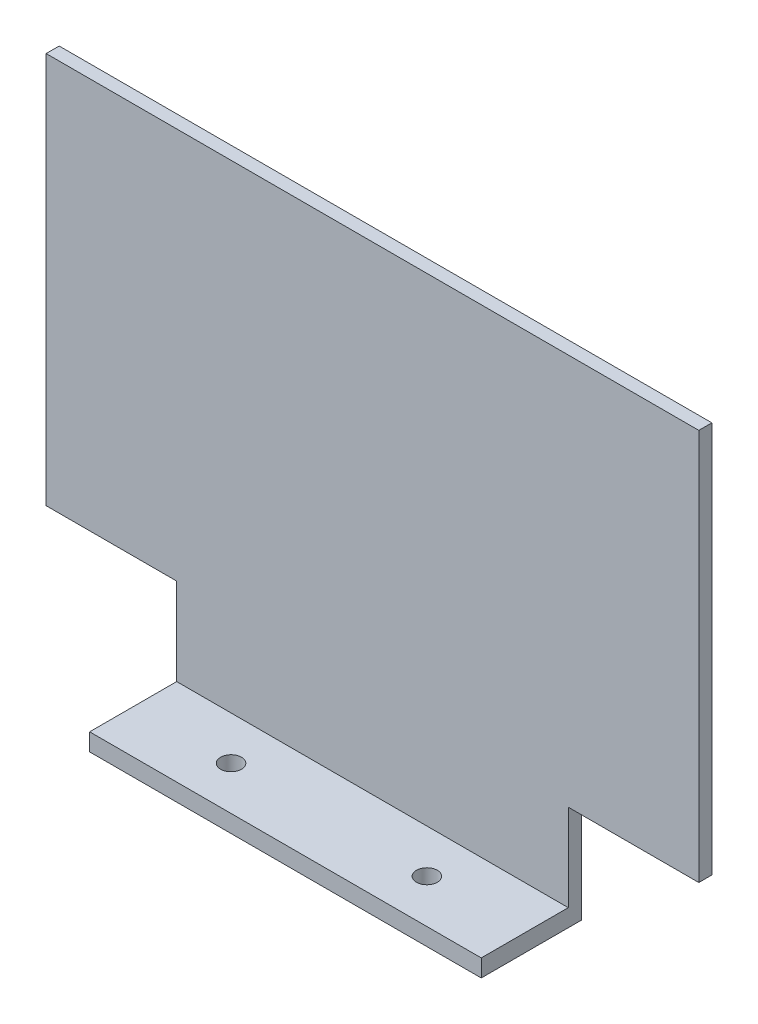
ISO-10303-21;
HEADER;
FILE_DESCRIPTION(('STEP AP214'),'2;1');
FILE_NAME('part.step','',(''),(''),'','','');
FILE_SCHEMA(('AUTOMOTIVE_DESIGN { 1 0 10303 214 1 1 1 1 }'));
ENDSEC;
DATA;
#1=APPLICATION_CONTEXT('core data for automotive mechanical design processes');
#2=APPLICATION_PROTOCOL_DEFINITION('international standard','automotive_design',2000,#1);
#3=PRODUCT_CONTEXT('',#1,'mechanical');
#4=PRODUCT('Part','Part','',(#3));
#5=PRODUCT_RELATED_PRODUCT_CATEGORY('part','',(#4));
#6=PRODUCT_DEFINITION_FORMATION('','',#4);
#7=PRODUCT_DEFINITION_CONTEXT('part definition',#1,'design');
#8=PRODUCT_DEFINITION('design','',#6,#7);
#9=PRODUCT_DEFINITION_SHAPE('','',#8);
#10=(LENGTH_UNIT() NAMED_UNIT(*) SI_UNIT(.MILLI.,.METRE.));
#11=(NAMED_UNIT(*) PLANE_ANGLE_UNIT() SI_UNIT($,.RADIAN.));
#12=(NAMED_UNIT(*) SI_UNIT($,.STERADIAN.) SOLID_ANGLE_UNIT());
#13=UNCERTAINTY_MEASURE_WITH_UNIT(LENGTH_MEASURE(1.E-05),#10,'distance_accuracy_value','');
#14=(GEOMETRIC_REPRESENTATION_CONTEXT(3) GLOBAL_UNCERTAINTY_ASSIGNED_CONTEXT((#13)) GLOBAL_UNIT_ASSIGNED_CONTEXT((#10,
#11,#12)) REPRESENTATION_CONTEXT('',''));
#15=CARTESIAN_POINT('',(0.,0.,0.));
#16=DIRECTION('',(0.,0.,1.));
#17=DIRECTION('',(1.,0.,0.));
#18=AXIS2_PLACEMENT_3D('',#15,#16,#17);
#19=CARTESIAN_POINT('',(-75.,-45.,3.));
#20=DIRECTION('',(0.,1.,0.));
#21=DIRECTION('',(0.,0.,1.));
#22=AXIS2_PLACEMENT_3D('',#19,#20,#21);
#23=PLANE('',#22);
#24=DIRECTION('',(0.,0.,-1.));
#25=VECTOR('',#24,1.);
#26=CARTESIAN_POINT('',(-45.,-45.,3.));
#27=LINE('',#26,#25);
#28=CARTESIAN_POINT('',(-45.,-45.,3.));
#29=VERTEX_POINT('',#28);
#30=CARTESIAN_POINT('',(-45.,-45.,0.));
#31=VERTEX_POINT('',#30);
#32=EDGE_CURVE('E176',#29,#31,#27,.T.);
#33=ORIENTED_EDGE('',*,*,#32,.F.);
#34=DIRECTION('',(1.,0.,0.));
#35=VECTOR('',#34,1.);
#36=CARTESIAN_POINT('',(-75.,-45.,3.));
#37=LINE('',#36,#35);
#38=CARTESIAN_POINT('',(-75.,-45.,3.));
#39=VERTEX_POINT('',#38);
#40=EDGE_CURVE('E92',#39,#29,#37,.T.);
#41=ORIENTED_EDGE('',*,*,#40,.F.);
#42=DIRECTION('',(0.,0.,-1.));
#43=VECTOR('',#42,1.);
#44=CARTESIAN_POINT('',(-75.,-45.,3.));
#45=LINE('',#44,#43);
#46=CARTESIAN_POINT('',(-75.,-45.,0.));
#47=VERTEX_POINT('',#46);
#48=EDGE_CURVE('E11',#39,#47,#45,.T.);
#49=ORIENTED_EDGE('',*,*,#48,.T.);
#50=DIRECTION('',(1.,0.,0.));
#51=VECTOR('',#50,1.);
#52=CARTESIAN_POINT('',(-75.,-45.,0.));
#53=LINE('',#52,#51);
#54=EDGE_CURVE('E202',#47,#31,#53,.T.);
#55=ORIENTED_EDGE('',*,*,#54,.T.);
#56=EDGE_LOOP('',(#33,#41,#49,#55));
#57=FACE_BOUND('',#56,.T.);
#58=ADVANCED_FACE('F41',(#57),#23,.F.);
#59=CARTESIAN_POINT('',(-75.,45.,3.));
#60=DIRECTION('',(1.,0.,0.));
#61=DIRECTION('',(0.,1.,0.));
#62=AXIS2_PLACEMENT_3D('',#59,#60,#61);
#63=PLANE('',#62);
#64=DIRECTION('',(0.,-1.,0.));
#65=VECTOR('',#64,1.);
#66=CARTESIAN_POINT('',(-75.,45.,0.));
#67=LINE('',#66,#65);
#68=CARTESIAN_POINT('',(-75.,45.,0.));
#69=VERTEX_POINT('',#68);
#70=EDGE_CURVE('E185',#69,#47,#67,.T.);
#71=ORIENTED_EDGE('',*,*,#70,.T.);
#72=ORIENTED_EDGE('',*,*,#48,.F.);
#73=DIRECTION('',(0.,-1.,0.));
#74=VECTOR('',#73,1.);
#75=CARTESIAN_POINT('',(-75.,45.,3.));
#76=LINE('',#75,#74);
#77=CARTESIAN_POINT('',(-75.,45.,3.));
#78=VERTEX_POINT('',#77);
#79=EDGE_CURVE('E186',#78,#39,#76,.T.);
#80=ORIENTED_EDGE('',*,*,#79,.F.);
#81=DIRECTION('',(0.,0.,-1.));
#82=VECTOR('',#81,1.);
#83=CARTESIAN_POINT('',(-75.,45.,3.));
#84=LINE('',#83,#82);
#85=EDGE_CURVE('E66',#78,#69,#84,.T.);
#86=ORIENTED_EDGE('',*,*,#85,.T.);
#87=EDGE_LOOP('',(#71,#72,#80,#86));
#88=FACE_BOUND('',#87,.T.);
#89=ADVANCED_FACE('F43',(#88),#63,.F.);
#90=CARTESIAN_POINT('',(45.,-45.,3.));
#91=VERTEX_POINT('',#90);
#92=CARTESIAN_POINT('',(75.,-45.,3.));
#93=VERTEX_POINT('',#92);
#94=EDGE_CURVE('E189',#91,#93,#37,.T.);
#95=ORIENTED_EDGE('',*,*,#94,.F.);
#96=DIRECTION('',(0.,0.,-1.));
#97=VECTOR('',#96,1.);
#98=CARTESIAN_POINT('',(45.,-45.,3.));
#99=LINE('',#98,#97);
#100=CARTESIAN_POINT('',(45.,-45.,0.));
#101=VERTEX_POINT('',#100);
#102=EDGE_CURVE('E182',#91,#101,#99,.T.);
#103=ORIENTED_EDGE('',*,*,#102,.T.);
#104=CARTESIAN_POINT('',(75.,-45.,0.));
#105=VERTEX_POINT('',#104);
#106=EDGE_CURVE('E201',#101,#105,#53,.T.);
#107=ORIENTED_EDGE('',*,*,#106,.T.);
#108=DIRECTION('',(0.,0.,-1.));
#109=VECTOR('',#108,1.);
#110=CARTESIAN_POINT('',(75.,-45.,3.));
#111=LINE('',#110,#109);
#112=EDGE_CURVE('E50',#93,#105,#111,.T.);
#113=ORIENTED_EDGE('',*,*,#112,.F.);
#114=EDGE_LOOP('',(#95,#103,#107,#113));
#115=FACE_BOUND('',#114,.T.);
#116=ADVANCED_FACE('F285',(#115),#23,.F.);
#117=CARTESIAN_POINT('',(75.,45.,3.));
#118=DIRECTION('',(1.,0.,0.));
#119=DIRECTION('',(0.,0.,-1.));
#120=AXIS2_PLACEMENT_3D('',#117,#118,#119);
#121=PLANE('',#120);
#122=DIRECTION('',(0.,-1.,0.));
#123=VECTOR('',#122,1.);
#124=CARTESIAN_POINT('',(75.,45.,0.));
#125=LINE('',#124,#123);
#126=CARTESIAN_POINT('',(75.,45.,0.));
#127=VERTEX_POINT('',#126);
#128=EDGE_CURVE('E206',#127,#105,#125,.T.);
#129=ORIENTED_EDGE('',*,*,#128,.F.);
#130=DIRECTION('',(0.,0.,-1.));
#131=VECTOR('',#130,1.);
#132=CARTESIAN_POINT('',(75.,45.,3.));
#133=LINE('',#132,#131);
#134=CARTESIAN_POINT('',(75.,45.,3.));
#135=VERTEX_POINT('',#134);
#136=EDGE_CURVE('E215',#135,#127,#133,.T.);
#137=ORIENTED_EDGE('',*,*,#136,.F.);
#138=DIRECTION('',(0.,-1.,0.));
#139=VECTOR('',#138,1.);
#140=CARTESIAN_POINT('',(75.,45.,3.));
#141=LINE('',#140,#139);
#142=EDGE_CURVE('E193',#135,#93,#141,.T.);
#143=ORIENTED_EDGE('',*,*,#142,.T.);
#144=ORIENTED_EDGE('',*,*,#112,.T.);
#145=EDGE_LOOP('',(#129,#137,#143,#144));
#146=FACE_BOUND('',#145,.T.);
#147=ADVANCED_FACE('F223',(#146),#121,.T.);
#148=CARTESIAN_POINT('',(-75.,45.,3.));
#149=DIRECTION('',(0.,1.,0.));
#150=DIRECTION('',(0.,0.,1.));
#151=AXIS2_PLACEMENT_3D('',#148,#149,#150);
#152=PLANE('',#151);
#153=DIRECTION('',(1.,0.,0.));
#154=VECTOR('',#153,1.);
#155=CARTESIAN_POINT('',(-75.,45.,0.));
#156=LINE('',#155,#154);
#157=EDGE_CURVE('E190',#69,#127,#156,.T.);
#158=ORIENTED_EDGE('',*,*,#157,.F.);
#159=ORIENTED_EDGE('',*,*,#85,.F.);
#160=DIRECTION('',(1.,0.,0.));
#161=VECTOR('',#160,1.);
#162=CARTESIAN_POINT('',(-75.,45.,3.));
#163=LINE('',#162,#161);
#164=EDGE_CURVE('E197',#78,#135,#163,.T.);
#165=ORIENTED_EDGE('',*,*,#164,.T.);
#166=ORIENTED_EDGE('',*,*,#136,.T.);
#167=EDGE_LOOP('',(#158,#159,#165,#166));
#168=FACE_BOUND('',#167,.T.);
#169=ADVANCED_FACE('F230',(#168),#152,.T.);
#170=CARTESIAN_POINT('',(0.,0.,3.));
#171=DIRECTION('',(0.,0.,1.));
#172=DIRECTION('',(1.,0.,0.));
#173=AXIS2_PLACEMENT_3D('',#170,#171,#172);
#174=PLANE('',#173);
#175=ORIENTED_EDGE('',*,*,#79,.T.);
#176=ORIENTED_EDGE('',*,*,#40,.T.);
#177=DIRECTION('',(0.,-1.,0.));
#178=VECTOR('',#177,1.);
#179=CARTESIAN_POINT('',(-45.,-45.,3.));
#180=LINE('',#179,#178);
#181=CARTESIAN_POINT('',(-45.,-65.,3.));
#182=VERTEX_POINT('',#181);
#183=EDGE_CURVE('E167',#29,#182,#180,.T.);
#184=ORIENTED_EDGE('',*,*,#183,.T.);
#185=DIRECTION('',(1.,0.,0.));
#186=VECTOR('',#185,1.);
#187=CARTESIAN_POINT('',(-45.,-65.,3.));
#188=LINE('',#187,#186);
#189=CARTESIAN_POINT('',(45.,-65.,3.));
#190=VERTEX_POINT('',#189);
#191=EDGE_CURVE('E170',#182,#190,#188,.T.);
#192=ORIENTED_EDGE('',*,*,#191,.T.);
#193=DIRECTION('',(0.,1.,0.));
#194=VECTOR('',#193,1.);
#195=CARTESIAN_POINT('',(45.,-45.,3.));
#196=LINE('',#195,#194);
#197=EDGE_CURVE('E174',#190,#91,#196,.T.);
#198=ORIENTED_EDGE('',*,*,#197,.T.);
#199=ORIENTED_EDGE('',*,*,#94,.T.);
#200=ORIENTED_EDGE('',*,*,#142,.F.);
#201=ORIENTED_EDGE('',*,*,#164,.F.);
#202=EDGE_LOOP('',(#175,#176,#184,#192,#198,#199,#200,#201));
#203=FACE_BOUND('',#202,.T.);
#204=ADVANCED_FACE('F233',(#203),#174,.T.);
#205=CARTESIAN_POINT('',(0.,0.,0.));
#206=DIRECTION('',(0.,0.,1.));
#207=DIRECTION('',(1.,0.,0.));
#208=AXIS2_PLACEMENT_3D('',#205,#206,#207);
#209=PLANE('',#208);
#210=ORIENTED_EDGE('',*,*,#70,.F.);
#211=ORIENTED_EDGE('',*,*,#157,.T.);
#212=ORIENTED_EDGE('',*,*,#128,.T.);
#213=ORIENTED_EDGE('',*,*,#106,.F.);
#214=DIRECTION('',(0.,1.,0.));
#215=VECTOR('',#214,1.);
#216=CARTESIAN_POINT('',(45.,-45.,0.));
#217=LINE('',#216,#215);
#218=CARTESIAN_POINT('',(45.,-69.,0.));
#219=VERTEX_POINT('',#218);
#220=EDGE_CURVE('E57',#219,#101,#217,.T.);
#221=ORIENTED_EDGE('',*,*,#220,.F.);
#222=DIRECTION('',(1.,0.,0.));
#223=VECTOR('',#222,1.);
#224=CARTESIAN_POINT('',(-45.,-69.,0.));
#225=LINE('',#224,#223);
#226=CARTESIAN_POINT('',(-45.,-69.,0.));
#227=VERTEX_POINT('',#226);
#228=EDGE_CURVE('E150',#227,#219,#225,.T.);
#229=ORIENTED_EDGE('',*,*,#228,.F.);
#230=DIRECTION('',(0.,-1.,0.));
#231=VECTOR('',#230,1.);
#232=CARTESIAN_POINT('',(-45.,-45.,0.));
#233=LINE('',#232,#231);
#234=EDGE_CURVE('E154',#31,#227,#233,.T.);
#235=ORIENTED_EDGE('',*,*,#234,.F.);
#236=ORIENTED_EDGE('',*,*,#54,.F.);
#237=EDGE_LOOP('',(#210,#211,#212,#213,#221,#229,#235,#236));
#238=FACE_BOUND('',#237,.T.);
#239=ADVANCED_FACE('F229',(#238),#209,.F.);
#240=CARTESIAN_POINT('',(-45.,-45.,3.));
#241=DIRECTION('',(1.,0.,0.));
#242=DIRECTION('',(0.,0.,-1.));
#243=AXIS2_PLACEMENT_3D('',#240,#241,#242);
#244=PLANE('',#243);
#245=ORIENTED_EDGE('',*,*,#234,.T.);
#246=DIRECTION('',(0.,0.,-1.));
#247=VECTOR('',#246,1.);
#248=CARTESIAN_POINT('',(-45.,-69.,23.));
#249=LINE('',#248,#247);
#250=CARTESIAN_POINT('',(-45.,-69.,23.));
#251=VERTEX_POINT('',#250);
#252=EDGE_CURVE('E134',#251,#227,#249,.T.);
#253=ORIENTED_EDGE('',*,*,#252,.F.);
#254=DIRECTION('',(0.,-1.,0.));
#255=VECTOR('',#254,1.);
#256=CARTESIAN_POINT('',(-45.,-65.,23.));
#257=LINE('',#256,#255);
#258=CARTESIAN_POINT('',(-45.,-65.,23.));
#259=VERTEX_POINT('',#258);
#260=EDGE_CURVE('E140',#259,#251,#257,.T.);
#261=ORIENTED_EDGE('',*,*,#260,.F.);
#262=DIRECTION('',(0.,0.,-1.));
#263=VECTOR('',#262,1.);
#264=CARTESIAN_POINT('',(-45.,-65.,23.));
#265=LINE('',#264,#263);
#266=EDGE_CURVE('E243',#259,#182,#265,.T.);
#267=ORIENTED_EDGE('',*,*,#266,.T.);
#268=ORIENTED_EDGE('',*,*,#183,.F.);
#269=ORIENTED_EDGE('',*,*,#32,.T.);
#270=EDGE_LOOP('',(#245,#253,#261,#267,#268,#269));
#271=FACE_BOUND('',#270,.T.);
#272=ADVANCED_FACE('F152',(#271),#244,.F.);
#273=CARTESIAN_POINT('',(45.,-45.,3.));
#274=DIRECTION('',(-1.,0.,0.));
#275=DIRECTION('',(0.,0.,1.));
#276=AXIS2_PLACEMENT_3D('',#273,#274,#275);
#277=PLANE('',#276);
#278=ORIENTED_EDGE('',*,*,#220,.T.);
#279=ORIENTED_EDGE('',*,*,#102,.F.);
#280=ORIENTED_EDGE('',*,*,#197,.F.);
#281=DIRECTION('',(0.,0.,-1.));
#282=VECTOR('',#281,1.);
#283=CARTESIAN_POINT('',(45.,-65.,23.));
#284=LINE('',#283,#282);
#285=CARTESIAN_POINT('',(45.,-65.,23.));
#286=VERTEX_POINT('',#285);
#287=EDGE_CURVE('E163',#286,#190,#284,.T.);
#288=ORIENTED_EDGE('',*,*,#287,.F.);
#289=DIRECTION('',(0.,1.,0.));
#290=VECTOR('',#289,1.);
#291=CARTESIAN_POINT('',(45.,-65.,23.));
#292=LINE('',#291,#290);
#293=CARTESIAN_POINT('',(45.,-69.,23.));
#294=VERTEX_POINT('',#293);
#295=EDGE_CURVE('E139',#294,#286,#292,.T.);
#296=ORIENTED_EDGE('',*,*,#295,.F.);
#297=DIRECTION('',(0.,0.,-1.));
#298=VECTOR('',#297,1.);
#299=CARTESIAN_POINT('',(45.,-69.,23.));
#300=LINE('',#299,#298);
#301=EDGE_CURVE('E135',#294,#219,#300,.T.);
#302=ORIENTED_EDGE('',*,*,#301,.T.);
#303=EDGE_LOOP('',(#278,#279,#280,#288,#296,#302));
#304=FACE_BOUND('',#303,.T.);
#305=ADVANCED_FACE('F271',(#304),#277,.F.);
#306=CARTESIAN_POINT('',(-45.,-69.,23.));
#307=DIRECTION('',(0.,1.,0.));
#308=DIRECTION('',(0.,0.,1.));
#309=AXIS2_PLACEMENT_3D('',#306,#307,#308);
#310=PLANE('',#309);
#311=CARTESIAN_POINT('',(-22.5,-69.,13.));
#312=DIRECTION('',(0.,-1.,0.));
#313=DIRECTION('',(0.,0.,-1.));
#314=AXIS2_PLACEMENT_3D('',#311,#312,#313);
#315=CIRCLE('',#314,2.4);
#316=CARTESIAN_POINT('',(-22.5,-69.,10.6));
#317=VERTEX_POINT('',#316);
#318=EDGE_CURVE('E240',#317,#317,#315,.T.);
#319=ORIENTED_EDGE('',*,*,#318,.F.);
#320=EDGE_LOOP('',(#319));
#321=FACE_BOUND('',#320,.T.);
#322=CARTESIAN_POINT('',(22.5,-69.,13.));
#323=DIRECTION('',(0.,-1.,0.));
#324=DIRECTION('',(0.,0.,1.));
#325=AXIS2_PLACEMENT_3D('',#322,#323,#324);
#326=CIRCLE('',#325,2.40000000000001);
#327=CARTESIAN_POINT('',(22.5,-69.,15.4));
#328=VERTEX_POINT('',#327);
#329=EDGE_CURVE('E238',#328,#328,#326,.T.);
#330=ORIENTED_EDGE('',*,*,#329,.F.);
#331=EDGE_LOOP('',(#330));
#332=FACE_BOUND('',#331,.T.);
#333=ORIENTED_EDGE('',*,*,#228,.T.);
#334=ORIENTED_EDGE('',*,*,#301,.F.);
#335=DIRECTION('',(1.,0.,0.));
#336=VECTOR('',#335,1.);
#337=CARTESIAN_POINT('',(-45.,-69.,23.));
#338=LINE('',#337,#336);
#339=EDGE_CURVE('E129',#251,#294,#338,.T.);
#340=ORIENTED_EDGE('',*,*,#339,.F.);
#341=ORIENTED_EDGE('',*,*,#252,.T.);
#342=EDGE_LOOP('',(#333,#334,#340,#341));
#343=FACE_BOUND('',#342,.T.);
#344=ADVANCED_FACE('F132',(#321,#332,#343),#310,.F.);
#345=CARTESIAN_POINT('',(-45.,-65.,23.));
#346=DIRECTION('',(0.,-1.,0.));
#347=DIRECTION('',(0.,0.,-1.));
#348=AXIS2_PLACEMENT_3D('',#345,#346,#347);
#349=PLANE('',#348);
#350=CARTESIAN_POINT('',(-22.5,-65.,13.));
#351=DIRECTION('',(0.,-1.,0.));
#352=DIRECTION('',(0.,0.,-1.));
#353=AXIS2_PLACEMENT_3D('',#350,#351,#352);
#354=CIRCLE('',#353,2.4);
#355=CARTESIAN_POINT('',(-22.5,-65.,10.6));
#356=VERTEX_POINT('',#355);
#357=EDGE_CURVE('E250',#356,#356,#354,.F.);
#358=ORIENTED_EDGE('',*,*,#357,.F.);
#359=EDGE_LOOP('',(#358));
#360=FACE_BOUND('',#359,.T.);
#361=CARTESIAN_POINT('',(22.5,-65.,13.));
#362=DIRECTION('',(0.,-1.,0.));
#363=DIRECTION('',(0.,0.,-1.));
#364=AXIS2_PLACEMENT_3D('',#361,#362,#363);
#365=CIRCLE('',#364,2.40000000000001);
#366=CARTESIAN_POINT('',(22.5,-65.,10.6));
#367=VERTEX_POINT('',#366);
#368=EDGE_CURVE('E241',#367,#367,#365,.F.);
#369=ORIENTED_EDGE('',*,*,#368,.F.);
#370=EDGE_LOOP('',(#369));
#371=FACE_BOUND('',#370,.T.);
#372=ORIENTED_EDGE('',*,*,#191,.F.);
#373=ORIENTED_EDGE('',*,*,#266,.F.);
#374=DIRECTION('',(-1.,0.,0.));
#375=VECTOR('',#374,1.);
#376=CARTESIAN_POINT('',(-45.,-65.,23.));
#377=LINE('',#376,#375);
#378=EDGE_CURVE('E145',#286,#259,#377,.T.);
#379=ORIENTED_EDGE('',*,*,#378,.F.);
#380=ORIENTED_EDGE('',*,*,#287,.T.);
#381=EDGE_LOOP('',(#372,#373,#379,#380));
#382=FACE_BOUND('',#381,.T.);
#383=ADVANCED_FACE('F270',(#360,#371,#382),#349,.F.);
#384=CARTESIAN_POINT('',(0.,0.,23.));
#385=DIRECTION('',(0.,0.,1.));
#386=DIRECTION('',(1.,0.,0.));
#387=AXIS2_PLACEMENT_3D('',#384,#385,#386);
#388=PLANE('',#387);
#389=ORIENTED_EDGE('',*,*,#260,.T.);
#390=ORIENTED_EDGE('',*,*,#339,.T.);
#391=ORIENTED_EDGE('',*,*,#295,.T.);
#392=ORIENTED_EDGE('',*,*,#378,.T.);
#393=EDGE_LOOP('',(#389,#390,#391,#392));
#394=FACE_BOUND('',#393,.T.);
#395=ADVANCED_FACE('F143',(#394),#388,.T.);
#396=CARTESIAN_POINT('',(22.5,45.001,13.));
#397=DIRECTION('',(0.,-1.,0.));
#398=DIRECTION('',(0.,0.,-1.));
#399=AXIS2_PLACEMENT_3D('',#396,#397,#398);
#400=CYLINDRICAL_SURFACE('',#399,2.40000000000001);
#401=ORIENTED_EDGE('',*,*,#329,.T.);
#402=EDGE_LOOP('',(#401));
#403=FACE_BOUND('',#402,.T.);
#404=ORIENTED_EDGE('',*,*,#368,.T.);
#405=EDGE_LOOP('',(#404));
#406=FACE_BOUND('',#405,.T.);
#407=ADVANCED_FACE('F275',(#403,#406),#400,.F.);
#408=CARTESIAN_POINT('',(-22.5,45.001,13.));
#409=DIRECTION('',(0.,-1.,0.));
#410=DIRECTION('',(0.,0.,-1.));
#411=AXIS2_PLACEMENT_3D('',#408,#409,#410);
#412=CYLINDRICAL_SURFACE('',#411,2.4);
#413=ORIENTED_EDGE('',*,*,#318,.T.);
#414=EDGE_LOOP('',(#413));
#415=FACE_BOUND('',#414,.T.);
#416=ORIENTED_EDGE('',*,*,#357,.T.);
#417=EDGE_LOOP('',(#416));
#418=FACE_BOUND('',#417,.T.);
#419=ADVANCED_FACE('F265',(#415,#418),#412,.F.);
#420=CLOSED_SHELL('',(#58,#89,#116,#147,#169,#204,#239,#272,#305,#344,#383,#395,#407,#419));
#421=MANIFOLD_SOLID_BREP('B2',#420);
#422=ADVANCED_BREP_SHAPE_REPRESENTATION('',(#18,#421),#14);
#423=SHAPE_DEFINITION_REPRESENTATION(#9,#422);
ENDSEC;
END-ISO-10303-21;
